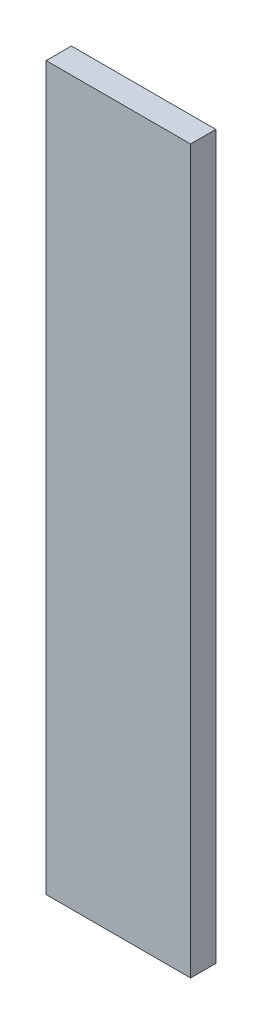
ISO-10303-21;
HEADER;
FILE_DESCRIPTION(('STEP AP214'),'2;1');
FILE_NAME('part.step','',(''),(''),'','','');
FILE_SCHEMA(('AUTOMOTIVE_DESIGN { 1 0 10303 214 1 1 1 1 }'));
ENDSEC;
DATA;
#1=APPLICATION_CONTEXT('core data for automotive mechanical design processes');
#2=APPLICATION_PROTOCOL_DEFINITION('international standard','automotive_design',2000,#1);
#3=PRODUCT_CONTEXT('',#1,'mechanical');
#4=PRODUCT('Part','Part','',(#3));
#5=PRODUCT_RELATED_PRODUCT_CATEGORY('part','',(#4));
#6=PRODUCT_DEFINITION_FORMATION('','',#4);
#7=PRODUCT_DEFINITION_CONTEXT('part definition',#1,'design');
#8=PRODUCT_DEFINITION('design','',#6,#7);
#9=PRODUCT_DEFINITION_SHAPE('','',#8);
#10=(LENGTH_UNIT() NAMED_UNIT(*) SI_UNIT(.MILLI.,.METRE.));
#11=(NAMED_UNIT(*) PLANE_ANGLE_UNIT() SI_UNIT($,.RADIAN.));
#12=(NAMED_UNIT(*) SI_UNIT($,.STERADIAN.) SOLID_ANGLE_UNIT());
#13=UNCERTAINTY_MEASURE_WITH_UNIT(LENGTH_MEASURE(1.E-05),#10,'distance_accuracy_value','');
#14=(GEOMETRIC_REPRESENTATION_CONTEXT(3) GLOBAL_UNCERTAINTY_ASSIGNED_CONTEXT((#13)) GLOBAL_UNIT_ASSIGNED_CONTEXT((#10,
#11,#12)) REPRESENTATION_CONTEXT('',''));
#15=CARTESIAN_POINT('',(0.,0.,0.));
#16=DIRECTION('',(0.,0.,1.));
#17=DIRECTION('',(1.,0.,0.));
#18=AXIS2_PLACEMENT_3D('',#15,#16,#17);
#19=CARTESIAN_POINT('',(0.,0.,8.89));
#20=DIRECTION('',(1.,0.,0.));
#21=DIRECTION('',(0.,1.,0.));
#22=AXIS2_PLACEMENT_3D('',#19,#20,#21);
#23=PLANE('',#22);
#24=DIRECTION('',(0.,-1.,0.));
#25=VECTOR('',#24,1.);
#26=CARTESIAN_POINT('',(0.,0.,0.));
#27=LINE('',#26,#25);
#28=CARTESIAN_POINT('',(0.,0.,0.));
#29=VERTEX_POINT('',#28);
#30=CARTESIAN_POINT('',(0.,-254.,0.));
#31=VERTEX_POINT('',#30);
#32=EDGE_CURVE('E95',#29,#31,#27,.T.);
#33=ORIENTED_EDGE('',*,*,#32,.T.);
#34=DIRECTION('',(0.,0.,-1.));
#35=VECTOR('',#34,1.);
#36=CARTESIAN_POINT('',(0.,-254.,8.89));
#37=LINE('',#36,#35);
#38=CARTESIAN_POINT('',(0.,-254.,8.89));
#39=VERTEX_POINT('',#38);
#40=EDGE_CURVE('E11',#39,#31,#37,.T.);
#41=ORIENTED_EDGE('',*,*,#40,.F.);
#42=DIRECTION('',(0.,-1.,0.));
#43=VECTOR('',#42,1.);
#44=CARTESIAN_POINT('',(0.,0.,8.89));
#45=LINE('',#44,#43);
#46=CARTESIAN_POINT('',(0.,0.,8.89));
#47=VERTEX_POINT('',#46);
#48=EDGE_CURVE('E83',#47,#39,#45,.T.);
#49=ORIENTED_EDGE('',*,*,#48,.F.);
#50=DIRECTION('',(0.,0.,-1.));
#51=VECTOR('',#50,1.);
#52=CARTESIAN_POINT('',(0.,0.,8.89));
#53=LINE('',#52,#51);
#54=EDGE_CURVE('E91',#47,#29,#53,.T.);
#55=ORIENTED_EDGE('',*,*,#54,.T.);
#56=EDGE_LOOP('',(#33,#41,#49,#55));
#57=FACE_BOUND('',#56,.T.);
#58=ADVANCED_FACE('F32',(#57),#23,.F.);
#59=CARTESIAN_POINT('',(0.,-254.,8.89));
#60=DIRECTION('',(0.,1.,0.));
#61=DIRECTION('',(0.,0.,1.));
#62=AXIS2_PLACEMENT_3D('',#59,#60,#61);
#63=PLANE('',#62);
#64=DIRECTION('',(1.,0.,0.));
#65=VECTOR('',#64,1.);
#66=CARTESIAN_POINT('',(0.,-254.,0.));
#67=LINE('',#66,#65);
#68=CARTESIAN_POINT('',(50.8,-254.,0.));
#69=VERTEX_POINT('',#68);
#70=EDGE_CURVE('E87',#31,#69,#67,.T.);
#71=ORIENTED_EDGE('',*,*,#70,.T.);
#72=DIRECTION('',(0.,0.,-1.));
#73=VECTOR('',#72,1.);
#74=CARTESIAN_POINT('',(50.8,-254.,8.89));
#75=LINE('',#74,#73);
#76=CARTESIAN_POINT('',(50.8,-254.,8.89));
#77=VERTEX_POINT('',#76);
#78=EDGE_CURVE('E40',#77,#69,#75,.T.);
#79=ORIENTED_EDGE('',*,*,#78,.F.);
#80=DIRECTION('',(1.,0.,0.));
#81=VECTOR('',#80,1.);
#82=CARTESIAN_POINT('',(0.,-254.,8.89));
#83=LINE('',#82,#81);
#84=EDGE_CURVE('E78',#39,#77,#83,.T.);
#85=ORIENTED_EDGE('',*,*,#84,.F.);
#86=ORIENTED_EDGE('',*,*,#40,.T.);
#87=EDGE_LOOP('',(#71,#79,#85,#86));
#88=FACE_BOUND('',#87,.T.);
#89=ADVANCED_FACE('F86',(#88),#63,.F.);
#90=CARTESIAN_POINT('',(50.8,0.,8.89));
#91=DIRECTION('',(-1.,0.,0.));
#92=DIRECTION('',(0.,-1.,0.));
#93=AXIS2_PLACEMENT_3D('',#90,#91,#92);
#94=PLANE('',#93);
#95=DIRECTION('',(0.,1.,0.));
#96=VECTOR('',#95,1.);
#97=CARTESIAN_POINT('',(50.8,0.,0.));
#98=LINE('',#97,#96);
#99=CARTESIAN_POINT('',(50.8,0.,0.));
#100=VERTEX_POINT('',#99);
#101=EDGE_CURVE('E65',#69,#100,#98,.T.);
#102=ORIENTED_EDGE('',*,*,#101,.T.);
#103=DIRECTION('',(0.,0.,-1.));
#104=VECTOR('',#103,1.);
#105=CARTESIAN_POINT('',(50.8,0.,8.89));
#106=LINE('',#105,#104);
#107=CARTESIAN_POINT('',(50.8,0.,8.89));
#108=VERTEX_POINT('',#107);
#109=EDGE_CURVE('E88',#108,#100,#106,.T.);
#110=ORIENTED_EDGE('',*,*,#109,.F.);
#111=DIRECTION('',(0.,1.,0.));
#112=VECTOR('',#111,1.);
#113=CARTESIAN_POINT('',(50.8,0.,8.89));
#114=LINE('',#113,#112);
#115=EDGE_CURVE('E81',#77,#108,#114,.T.);
#116=ORIENTED_EDGE('',*,*,#115,.F.);
#117=ORIENTED_EDGE('',*,*,#78,.T.);
#118=EDGE_LOOP('',(#102,#110,#116,#117));
#119=FACE_BOUND('',#118,.T.);
#120=ADVANCED_FACE('F89',(#119),#94,.F.);
#121=CARTESIAN_POINT('',(0.,0.,8.89));
#122=DIRECTION('',(0.,-1.,0.));
#123=DIRECTION('',(0.,0.,-1.));
#124=AXIS2_PLACEMENT_3D('',#121,#122,#123);
#125=PLANE('',#124);
#126=DIRECTION('',(-1.,0.,0.));
#127=VECTOR('',#126,1.);
#128=CARTESIAN_POINT('',(0.,0.,0.));
#129=LINE('',#128,#127);
#130=EDGE_CURVE('E71',#100,#29,#129,.T.);
#131=ORIENTED_EDGE('',*,*,#130,.T.);
#132=ORIENTED_EDGE('',*,*,#54,.F.);
#133=DIRECTION('',(-1.,0.,0.));
#134=VECTOR('',#133,1.);
#135=CARTESIAN_POINT('',(0.,0.,8.89));
#136=LINE('',#135,#134);
#137=EDGE_CURVE('E48',#108,#47,#136,.T.);
#138=ORIENTED_EDGE('',*,*,#137,.F.);
#139=ORIENTED_EDGE('',*,*,#109,.T.);
#140=EDGE_LOOP('',(#131,#132,#138,#139));
#141=FACE_BOUND('',#140,.T.);
#142=ADVANCED_FACE('F102',(#141),#125,.F.);
#143=CARTESIAN_POINT('',(0.,0.,8.89));
#144=DIRECTION('',(0.,0.,1.));
#145=DIRECTION('',(1.,0.,0.));
#146=AXIS2_PLACEMENT_3D('',#143,#144,#145);
#147=PLANE('',#146);
#148=ORIENTED_EDGE('',*,*,#48,.T.);
#149=ORIENTED_EDGE('',*,*,#84,.T.);
#150=ORIENTED_EDGE('',*,*,#115,.T.);
#151=ORIENTED_EDGE('',*,*,#137,.T.);
#152=EDGE_LOOP('',(#148,#149,#150,#151));
#153=FACE_BOUND('',#152,.T.);
#154=ADVANCED_FACE('F79',(#153),#147,.T.);
#155=CARTESIAN_POINT('',(0.,0.,0.));
#156=DIRECTION('',(0.,0.,1.));
#157=DIRECTION('',(1.,0.,0.));
#158=AXIS2_PLACEMENT_3D('',#155,#156,#157);
#159=PLANE('',#158);
#160=ORIENTED_EDGE('',*,*,#32,.F.);
#161=ORIENTED_EDGE('',*,*,#130,.F.);
#162=ORIENTED_EDGE('',*,*,#101,.F.);
#163=ORIENTED_EDGE('',*,*,#70,.F.);
#164=EDGE_LOOP('',(#160,#161,#162,#163));
#165=FACE_BOUND('',#164,.T.);
#166=ADVANCED_FACE('F105',(#165),#159,.F.);
#167=CLOSED_SHELL('',(#58,#89,#120,#142,#154,#166));
#168=MANIFOLD_SOLID_BREP('B2',#167);
#169=ADVANCED_BREP_SHAPE_REPRESENTATION('',(#18,#168),#14);
#170=SHAPE_DEFINITION_REPRESENTATION(#9,#169);
ENDSEC;
END-ISO-10303-21;
